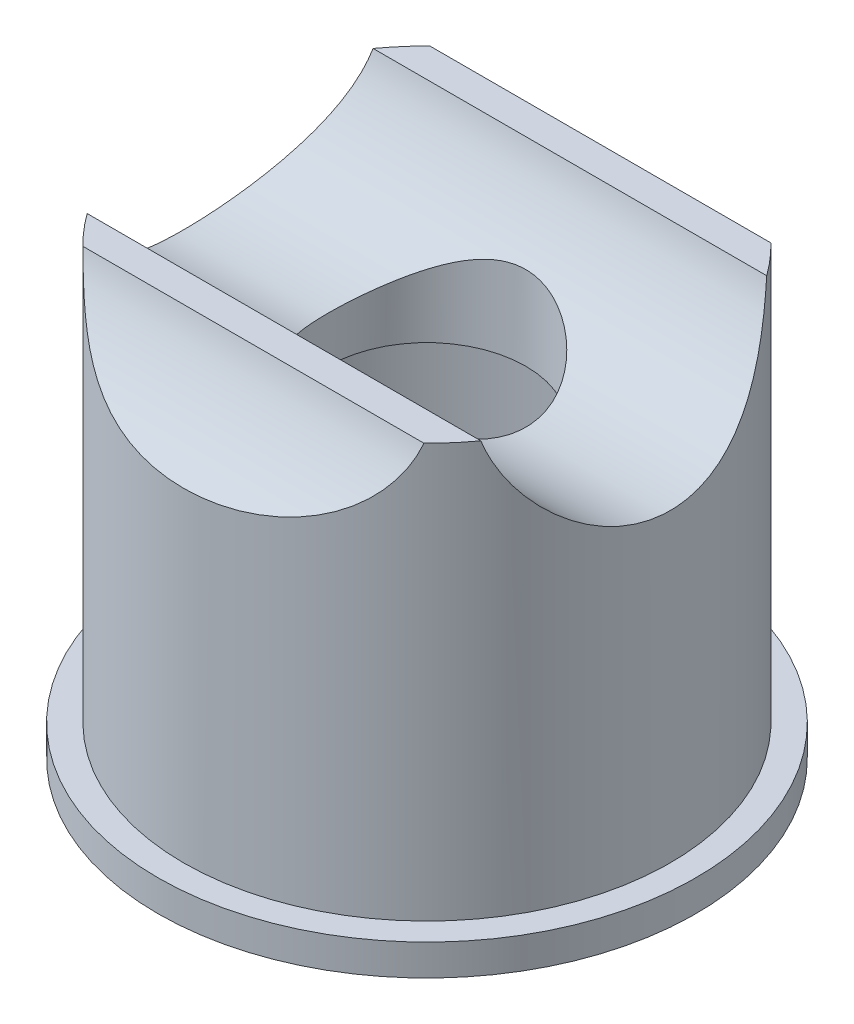
ISO-10303-21;
HEADER;
FILE_DESCRIPTION(('STEP AP214'),'2;1');
FILE_NAME('part.step','',(''),(''),'','','');
FILE_SCHEMA(('AUTOMOTIVE_DESIGN { 1 0 10303 214 1 1 1 1 }'));
ENDSEC;
DATA;
#1=APPLICATION_CONTEXT('core data for automotive mechanical design processes');
#2=APPLICATION_PROTOCOL_DEFINITION('international standard','automotive_design',2000,#1);
#3=PRODUCT_CONTEXT('',#1,'mechanical');
#4=PRODUCT('Part','Part','',(#3));
#5=PRODUCT_RELATED_PRODUCT_CATEGORY('part','',(#4));
#6=PRODUCT_DEFINITION_FORMATION('','',#4);
#7=PRODUCT_DEFINITION_CONTEXT('part definition',#1,'design');
#8=PRODUCT_DEFINITION('design','',#6,#7);
#9=PRODUCT_DEFINITION_SHAPE('','',#8);
#10=(LENGTH_UNIT() NAMED_UNIT(*) SI_UNIT(.MILLI.,.METRE.));
#11=(NAMED_UNIT(*) PLANE_ANGLE_UNIT() SI_UNIT($,.RADIAN.));
#12=(NAMED_UNIT(*) SI_UNIT($,.STERADIAN.) SOLID_ANGLE_UNIT());
#13=UNCERTAINTY_MEASURE_WITH_UNIT(LENGTH_MEASURE(1.E-05),#10,'distance_accuracy_value','');
#14=(GEOMETRIC_REPRESENTATION_CONTEXT(3) GLOBAL_UNCERTAINTY_ASSIGNED_CONTEXT((#13)) GLOBAL_UNIT_ASSIGNED_CONTEXT((#10,
#11,#12)) REPRESENTATION_CONTEXT('',''));
#15=CARTESIAN_POINT('',(0.,0.,0.));
#16=DIRECTION('',(0.,0.,1.));
#17=DIRECTION('',(1.,0.,0.));
#18=AXIS2_PLACEMENT_3D('',#15,#16,#17);
#19=CARTESIAN_POINT('',(0.,14.2875,0.));
#20=DIRECTION('',(0.,-1.,0.));
#21=DIRECTION('',(0.,0.,-1.));
#22=AXIS2_PLACEMENT_3D('',#19,#20,#21);
#23=CYLINDRICAL_SURFACE('',#22,8.636);
#24=CARTESIAN_POINT('',(0.,0.,0.));
#25=DIRECTION('',(0.,1.,0.));
#26=DIRECTION('',(0.,0.,1.));
#27=AXIS2_PLACEMENT_3D('',#24,#25,#26);
#28=CIRCLE('',#27,8.636);
#29=CARTESIAN_POINT('',(0.,0.,8.636));
#30=VERTEX_POINT('',#29);
#31=EDGE_CURVE('E92',#30,#30,#28,.T.);
#32=ORIENTED_EDGE('',*,*,#31,.T.);
#33=EDGE_LOOP('',(#32));
#34=FACE_BOUND('',#33,.T.);
#35=CARTESIAN_POINT('',(0.,0.999999999999999,0.));
#36=DIRECTION('',(0.,1.,0.));
#37=DIRECTION('',(0.,0.,1.));
#38=AXIS2_PLACEMENT_3D('',#35,#36,#37);
#39=CIRCLE('',#38,8.636);
#40=CARTESIAN_POINT('',(0.,0.999999999999999,8.636));
#41=VERTEX_POINT('',#40);
#42=EDGE_CURVE('E93',#41,#41,#39,.T.);
#43=ORIENTED_EDGE('',*,*,#42,.F.);
#44=EDGE_LOOP('',(#43));
#45=FACE_BOUND('',#44,.T.);
#46=ADVANCED_FACE('F35',(#34,#45),#23,.T.);
#47=CARTESIAN_POINT('',(0.,0.,0.));
#48=DIRECTION('',(0.,1.,0.));
#49=DIRECTION('',(0.,0.,1.));
#50=AXIS2_PLACEMENT_3D('',#47,#48,#49);
#51=PLANE('',#50);
#52=CARTESIAN_POINT('',(0.,0.,0.));
#53=DIRECTION('',(0.,1.,0.));
#54=DIRECTION('',(0.,0.,1.));
#55=AXIS2_PLACEMENT_3D('',#52,#53,#54);
#56=CIRCLE('',#55,7.7818);
#57=CARTESIAN_POINT('',(0.,0.,7.7818));
#58=VERTEX_POINT('',#57);
#59=EDGE_CURVE('E13',#58,#58,#56,.T.);
#60=ORIENTED_EDGE('',*,*,#59,.T.);
#61=EDGE_LOOP('',(#60));
#62=FACE_BOUND('',#61,.T.);
#63=ORIENTED_EDGE('',*,*,#31,.F.);
#64=EDGE_LOOP('',(#63));
#65=FACE_BOUND('',#64,.T.);
#66=ADVANCED_FACE('F175',(#62,#65),#51,.F.);
#67=CARTESIAN_POINT('',(0.,1.,0.));
#68=DIRECTION('',(0.,1.,0.));
#69=DIRECTION('',(0.,0.,1.));
#70=AXIS2_PLACEMENT_3D('',#67,#68,#69);
#71=PLANE('',#70);
#72=CARTESIAN_POINT('',(0.,1.,0.));
#73=DIRECTION('',(0.,1.,0.));
#74=DIRECTION('',(0.,0.,1.));
#75=AXIS2_PLACEMENT_3D('',#72,#73,#74);
#76=CIRCLE('',#75,7.8105);
#77=CARTESIAN_POINT('',(0.,1.,7.8105));
#78=VERTEX_POINT('',#77);
#79=EDGE_CURVE('E81',#78,#78,#76,.F.);
#80=ORIENTED_EDGE('',*,*,#79,.T.);
#81=EDGE_LOOP('',(#80));
#82=FACE_BOUND('',#81,.T.);
#83=ORIENTED_EDGE('',*,*,#42,.T.);
#84=EDGE_LOOP('',(#83));
#85=FACE_BOUND('',#84,.T.);
#86=ADVANCED_FACE('F127',(#82,#85),#71,.T.);
#87=CARTESIAN_POINT('',(0.,-24.6705596158012,0.));
#88=DIRECTION('',(0.,1.,0.));
#89=DIRECTION('',(0.,0.,1.));
#90=AXIS2_PLACEMENT_3D('',#87,#88,#89);
#91=CYLINDRICAL_SURFACE('',#90,7.8105);
#92=ORIENTED_EDGE('',*,*,#79,.F.);
#93=EDGE_LOOP('',(#92));
#94=FACE_BOUND('',#93,.T.);
#95=CARTESIAN_POINT('',(6.31944649474936,14.2875,-4.5900442535993));
#96=CARTESIAN_POINT('',(6.3459448331276,14.1555945571704,-4.55354104369366));
#97=CARTESIAN_POINT('',(6.37594767306263,14.0260762738664,-4.51159001928936));
#98=CARTESIAN_POINT('',(6.44157205161751,13.7724804518197,-4.41739810848748));
#99=CARTESIAN_POINT('',(6.4771869801665,13.6483967291085,-4.3651693097488));
#100=CARTESIAN_POINT('',(6.59018050800569,13.2857908252321,-4.19427296025745));
#101=CARTESIAN_POINT('',(6.67393683833757,13.0558723566797,-4.06110038894614));
#102=CARTESIAN_POINT('',(6.80418525062295,12.7318737221007,-3.83594792634909));
#103=CARTESIAN_POINT('',(6.84829480243364,12.6275071057137,-3.75681426350333));
#104=CARTESIAN_POINT('',(6.93701384745941,12.4257506882625,-3.59035569695324));
#105=CARTESIAN_POINT('',(6.9816233278826,12.3283607091532,-3.50303100241699));
#106=CARTESIAN_POINT('',(7.1147047259258,12.0469522384616,-3.22893469707014));
#107=CARTESIAN_POINT('',(7.20236176884486,11.8738569358692,-3.03015336093005));
#108=CARTESIAN_POINT('',(7.32897431117192,11.6336751584442,-2.70281244497699));
#109=CARTESIAN_POINT('',(7.37171042673759,11.554574838831,-2.58427290894523));
#110=CARTESIAN_POINT('',(7.45299439092094,11.4067844454627,-2.33952319840194));
#111=CARTESIAN_POINT('',(7.49154419608711,11.338089502586,-2.21331665059225));
#112=CARTESIAN_POINT('',(7.56329965909997,11.211964060112,-1.95409472077566));
#113=CARTESIAN_POINT('',(7.59651024901128,11.1545231538201,-1.82108577392781));
#114=CARTESIAN_POINT('',(7.65659863778372,11.0516433248164,-1.54912346194853));
#115=CARTESIAN_POINT('',(7.68347757236637,11.006202249494,-1.41017116817845));
#116=CARTESIAN_POINT('',(7.72744593399761,10.9323845095782,-1.14312565571556));
#117=CARTESIAN_POINT('',(7.74528760917973,10.9026794345231,-1.01552251027671));
#118=CARTESIAN_POINT('',(7.77475213335238,10.8538154706943,-0.757612395189718));
#119=CARTESIAN_POINT('',(7.7863758977093,10.8346550295861,-0.627305826460162));
#120=CARTESIAN_POINT('',(7.80306140620297,10.8071966319759,-0.365208943259196));
#121=CARTESIAN_POINT('',(7.80812684399766,10.7988925611265,-0.233419506168018));
#122=CARTESIAN_POINT('',(7.81155480826666,10.7932696833563,0.030475960199796));
#123=CARTESIAN_POINT('',(7.80991792028192,10.7959499168045,0.162581960812481));
#124=CARTESIAN_POINT('',(7.80059257515733,10.8112625708266,0.410001500374484));
#125=CARTESIAN_POINT('',(7.79365610015848,10.8226584792593,0.525422649626926));
#126=CARTESIAN_POINT('',(7.77479819315719,10.8537636043853,0.75476168011716));
#127=CARTESIAN_POINT('',(7.76287525328922,10.87347533573,0.868679095880669));
#128=CARTESIAN_POINT('',(7.73431421719726,10.9209632282834,1.0941656574162));
#129=CARTESIAN_POINT('',(7.71767815564419,10.9487359096785,1.2057357942377));
#130=CARTESIAN_POINT('',(7.68004999085637,11.0120292196131,1.42591937838375));
#131=CARTESIAN_POINT('',(7.65905620162005,11.0475528472609,1.53453166286441));
#132=CARTESIAN_POINT('',(7.58933915833914,11.1666223302576,1.85880254266141));
#133=CARTESIAN_POINT('',(7.53439477343751,11.2618339487242,2.06898233114453));
#134=CARTESIAN_POINT('',(7.41240048355558,11.4795961776805,2.4707261172935));
#135=CARTESIAN_POINT('',(7.34534197143789,11.6021662411398,2.66227672902237));
#136=CARTESIAN_POINT('',(7.1947292426526,11.8889319980013,3.0475896208374));
#137=CARTESIAN_POINT('',(7.11016236307069,12.0564490949588,3.23848970928986));
#138=CARTESIAN_POINT('',(6.93889640761993,12.4188192598922,3.59082860428513));
#139=CARTESIAN_POINT('',(6.85219786838382,12.6136655048652,3.7522747412343));
#140=CARTESIAN_POINT('',(6.67993826784907,13.0397603662859,4.05137897793576));
#141=CARTESIAN_POINT('',(6.59469952789987,13.2724181756638,4.18725011316603));
#142=CARTESIAN_POINT('',(6.47972552034991,13.6397195120202,4.36141926955737));
#143=CARTESIAN_POINT('',(6.44349826813045,13.7654322667229,4.41460030224131));
#144=CARTESIAN_POINT('',(6.3767887018944,14.0224455369685,4.51041414565521));
#145=CARTESIAN_POINT('',(6.3463130737242,14.1537523405932,4.55303469837239));
#146=CARTESIAN_POINT('',(6.31944649474936,14.2875,4.5900442535993));
#147=B_SPLINE_CURVE_WITH_KNOTS('',3,(#95,#96,#97,#98,#99,#100,#101,#102,#103,#104,#105,#106,
#107,#108,#109,#110,#111,#112,#113,#114,#115,#116,#117,#118,#119,#120,#121,#122,#123,#124,#125,
#126,#127,#128,#129,#130,#131,#132,#133,#134,#135,#136,#137,#138,#139,#140,#141,#142,#143,#144,
#145,#146),.UNSPECIFIED.,.F.,.F.,(4,2,2,2,2,2,2,2,2,2,2,2,2,2,2,2,2,2,2,2,2,2,2,2,2,4),(0.,
0.417760343736558,0.835032266047839,1.66630234534516,2.08059010946077,2.49486729710663,
3.32404032255111,3.76988842410777,4.215527245392,4.66075201565375,5.1058968641545,
5.50200249368627,5.89804979468257,6.29387394416335,6.68966351366335,7.0378218405443,
7.38608552381795,7.73419908895614,8.08244759085619,8.79090709630531,9.4998719591998,
10.2996890339228,11.0993067803423,11.9427156421478,12.3658432653113,12.7894597543947),.UNSPECIFIED.);
#148=CARTESIAN_POINT('',(6.31944649474936,14.2875,-4.5900442535993));
#149=VERTEX_POINT('',#148);
#150=CARTESIAN_POINT('',(6.31944649474936,14.2875,4.5900442535993));
#151=VERTEX_POINT('',#150);
#152=EDGE_CURVE('E76',#149,#151,#147,.T.);
#153=ORIENTED_EDGE('',*,*,#152,.T.);
#154=CARTESIAN_POINT('',(0.,14.2875,0.));
#155=DIRECTION('',(0.,1.,0.));
#156=DIRECTION('',(0.,0.,1.));
#157=AXIS2_PLACEMENT_3D('',#154,#155,#156);
#158=CIRCLE('',#157,7.8105);
#159=CARTESIAN_POINT('',(5.47535416508721,14.2875,5.5699557464007));
#160=VERTEX_POINT('',#159);
#161=EDGE_CURVE('E73',#160,#151,#158,.T.);
#162=ORIENTED_EDGE('',*,*,#161,.F.);
#163=CARTESIAN_POINT('',(5.47535416508721,14.2875,5.5699557464007));
#164=CARTESIAN_POINT('',(5.44700331511037,14.1867231884947,5.59781277957916));
#165=CARTESIAN_POINT('',(5.41508775394805,14.0878292428965,5.62877322927284));
#166=CARTESIAN_POINT('',(5.34423348807905,13.8945624139044,5.69609530731841));
#167=CARTESIAN_POINT('',(5.30529871652915,13.8001870358596,5.73245390885724));
#168=CARTESIAN_POINT('',(5.22076938469108,13.6172239377505,5.80953602899794));
#169=CARTESIAN_POINT('',(5.1752220068137,13.5286011657167,5.8502281203875));
#170=CARTESIAN_POINT('',(5.07746823874737,13.3569880522497,5.93527075529279));
#171=CARTESIAN_POINT('',(5.02526130174505,13.2739981741892,5.97962159912126));
#172=CARTESIAN_POINT('',(4.85915427050187,13.0343712530466,6.11661718399059));
#173=CARTESIAN_POINT('',(4.73556782068868,12.8866437064503,6.21339438996443));
#174=CARTESIAN_POINT('',(4.46540564750361,12.6165342307456,6.41030269646885));
#175=CARTESIAN_POINT('',(4.31879965722391,12.4941861701603,6.51043807416136));
#176=CARTESIAN_POINT('',(4.0617824742851,12.3130069490109,6.67234077271139));
#177=CARTESIAN_POINT('',(3.95693621127453,12.247024962303,6.73513902408238));
#178=CARTESIAN_POINT('',(3.74018998375592,12.1245919890717,6.85786981601166));
#179=CARTESIAN_POINT('',(3.62828831321704,12.0681433199818,6.9178016572499));
#180=CARTESIAN_POINT('',(3.39829122259294,11.9639805807971,7.0336434682709));
#181=CARTESIAN_POINT('',(3.28018705015663,11.9162793046934,7.08954747555255));
#182=CARTESIAN_POINT('',(3.038838721627,11.8288714839592,7.19630406713116));
#183=CARTESIAN_POINT('',(2.91559345610117,11.7891666758291,7.24715555301844));
#184=CARTESIAN_POINT('',(2.63250177539104,11.7076295793285,7.35542876736137));
#185=CARTESIAN_POINT('',(2.47140699724395,11.6678852098084,7.41116727629571));
#186=CARTESIAN_POINT('',(2.14395823507316,11.5982570904899,7.51243968663383));
#187=CARTESIAN_POINT('',(1.97760297390456,11.5683757557041,7.55797108790268));
#188=CARTESIAN_POINT('',(1.64095283945536,11.5172186235446,7.63813679795615));
#189=CARTESIAN_POINT('',(1.47065689554541,11.4959451945424,7.67276810711749));
#190=CARTESIAN_POINT('',(1.12739214602854,11.4610523057515,7.73066599626056));
#191=CARTESIAN_POINT('',(0.954423495637329,11.4474324031928,7.75393323366358));
#192=CARTESIAN_POINT('',(0.605069998804092,11.4270870458654,7.78902737533358));
#193=CARTESIAN_POINT('',(0.428668378987001,11.4204363031785,7.80073023062835));
#194=CARTESIAN_POINT('',(0.0753527993015615,11.4139525955918,7.81213637521598));
#195=CARTESIAN_POINT('',(-0.101561167537058,11.4141197238863,7.81183950048335));
#196=CARTESIAN_POINT('',(-0.454962293775418,11.4212831379051,7.79924382682879));
#197=CARTESIAN_POINT('',(-0.631449019654363,11.4282846818524,7.78693578682821));
#198=CARTESIAN_POINT('',(-0.982761820885241,11.4494763753113,7.75043736188553));
#199=CARTESIAN_POINT('',(-1.15758784932934,11.4636667272655,7.72624664231814));
#200=CARTESIAN_POINT('',(-1.51763588671332,11.5013061200482,7.66397742126415));
#201=CARTESIAN_POINT('',(-1.70263615882145,11.5253777501921,7.62498189088036));
#202=CARTESIAN_POINT('',(-2.06783564592269,11.5839347357998,7.5341468231194));
#203=CARTESIAN_POINT('',(-2.2480338984403,11.6184221620846,7.48230473201607));
#204=CARTESIAN_POINT('',(-2.60145563444365,11.6994159468394,7.36687344126714));
#205=CARTESIAN_POINT('',(-2.77469244451421,11.7458979392139,7.3033081303248));
#206=CARTESIAN_POINT('',(-3.11248989477583,11.8528962004662,7.16585650255264));
#207=CARTESIAN_POINT('',(-3.27705569236649,11.9134040086449,7.09197641847698));
#208=CARTESIAN_POINT('',(-3.54001844227188,12.0267490237722,6.96316048572241));
#209=CARTESIAN_POINT('',(-3.64156544871207,12.0749655801968,6.91054367275361));
#210=CARTESIAN_POINT('',(-3.83930251826676,12.1788383092132,6.80267095655516));
#211=CARTESIAN_POINT('',(-3.93549397316302,12.2344925360246,6.74741574598237));
#212=CARTESIAN_POINT('',(-4.12179077927068,12.3537126859969,6.63525227813975));
#213=CARTESIAN_POINT('',(-4.21189780056851,12.4172764243846,6.57834448066396));
#214=CARTESIAN_POINT('',(-4.38533877778011,12.5526778860196,6.46401589683021));
#215=CARTESIAN_POINT('',(-4.46867275094584,12.6245155881908,6.40659511177932));
#216=CARTESIAN_POINT('',(-4.62868778318713,12.7773918546136,6.29197462364408));
#217=CARTESIAN_POINT('',(-4.70529313445355,12.8585160310083,6.23478301304912));
#218=CARTESIAN_POINT('',(-4.85025319129479,13.0292655605653,6.12269146300042));
#219=CARTESIAN_POINT('',(-4.91860939027024,13.1188893697184,6.06779110992544));
#220=CARTESIAN_POINT('',(-5.04645713740746,13.3061060480051,5.96188428473108));
#221=CARTESIAN_POINT('',(-5.1059643995241,13.4036843025969,5.91087099048488));
#222=CARTESIAN_POINT('',(-5.21585389929367,13.6062382468805,5.81413254969051));
#223=CARTESIAN_POINT('',(-5.26624272791045,13.7112085166375,5.768403592242));
#224=CARTESIAN_POINT('',(-5.34372895317285,13.894585734095,5.69652117509602));
#225=CARTESIAN_POINT('',(-5.37324007047181,13.9713158407933,5.66865419077211));
#226=CARTESIAN_POINT('',(-5.42770618600222,14.1274641450065,5.61652197095321));
#227=CARTESIAN_POINT('',(-5.45266600150195,14.2068793936439,5.59225293240645));
#228=CARTESIAN_POINT('',(-5.47535416508721,14.2875,5.5699557464007));
#229=B_SPLINE_CURVE_WITH_KNOTS('',3,(#163,#164,#165,#166,#167,#168,#169,#170,#171,#172,#173,
#174,#175,#176,#177,#178,#179,#180,#181,#182,#183,#184,#185,#186,#187,#188,#189,#190,#191,#192,
#193,#194,#195,#196,#197,#198,#199,#200,#201,#202,#203,#204,#205,#206,#207,#208,#209,#210,#211,
#212,#213,#214,#215,#216,#217,#218,#219,#220,#221,#222,#223,#224,#225,#226,#227,#228),
.UNSPECIFIED.,.F.,.F.,(4,2,2,2,2,2,2,2,2,2,2,2,2,2,2,2,2,2,2,2,2,2,2,2,2,2,2,2,2,2,2,2,4),(0.,
0.324846621020494,0.649511779494691,0.971964902310887,1.29444451866945,1.9378842696916,
2.58217723403778,2.99833510981039,3.41459400333965,3.83145694656686,4.24841031771466,
4.77279898253336,5.29731595141742,5.82197713747297,6.34660796783304,6.87680723242998,
7.40701374437511,7.93762850530794,8.46825820961233,9.03928246916194,9.6104203319608,
10.1804069798886,10.7500506892423,11.1220834010711,11.4940189746934,11.8658520390189,
12.237684156201,12.6132723343391,12.9887924148436,13.3636374716725,13.7382104921413,
13.9984009758521,14.2583144450799),.UNSPECIFIED.);
#230=CARTESIAN_POINT('',(-5.47535416508721,14.2875,5.5699557464007));
#231=VERTEX_POINT('',#230);
#232=EDGE_CURVE('E57',#160,#231,#229,.T.);
#233=ORIENTED_EDGE('',*,*,#232,.T.);
#234=CARTESIAN_POINT('',(-6.31944649474936,14.2875,4.5900442535993));
#235=VERTEX_POINT('',#234);
#236=EDGE_CURVE('E84',#235,#231,#158,.T.);
#237=ORIENTED_EDGE('',*,*,#236,.F.);
#238=CARTESIAN_POINT('',(-6.31944649474936,14.2875,4.5900442535993));
#239=CARTESIAN_POINT('',(-6.3459448331276,14.1555945571705,4.55354104369366));
#240=CARTESIAN_POINT('',(-6.37594767306263,14.0260762738664,4.51159001928936));
#241=CARTESIAN_POINT('',(-6.44157205161751,13.7724804518197,4.41739810848748));
#242=CARTESIAN_POINT('',(-6.4771869801665,13.6483967291085,4.3651693097488));
#243=CARTESIAN_POINT('',(-6.59018050800569,13.2857908252321,4.19427296025745));
#244=CARTESIAN_POINT('',(-6.67393683833756,13.0558723566797,4.06110038894614));
#245=CARTESIAN_POINT('',(-6.80418525062295,12.7318737221007,3.83594792634909));
#246=CARTESIAN_POINT('',(-6.84829480243364,12.6275071057137,3.75681426350333));
#247=CARTESIAN_POINT('',(-6.93701384745941,12.4257506882625,3.59035569695324));
#248=CARTESIAN_POINT('',(-6.98162332788259,12.3283607091532,3.503031002417));
#249=CARTESIAN_POINT('',(-7.1147047259258,12.0469522384616,3.22893469707014));
#250=CARTESIAN_POINT('',(-7.20236176884485,11.8738569358692,3.03015336093005));
#251=CARTESIAN_POINT('',(-7.32897431117192,11.6336751584442,2.702812444977));
#252=CARTESIAN_POINT('',(-7.37171042673759,11.5545748388311,2.58427290894524));
#253=CARTESIAN_POINT('',(-7.45299439092093,11.4067844454627,2.33952319840195));
#254=CARTESIAN_POINT('',(-7.49154419608711,11.338089502586,2.21331665059226));
#255=CARTESIAN_POINT('',(-7.56329965909997,11.211964060112,1.95409472077566));
#256=CARTESIAN_POINT('',(-7.59651024901127,11.1545231538201,1.82108577392782));
#257=CARTESIAN_POINT('',(-7.65659863778371,11.0516433248164,1.54912346194854));
#258=CARTESIAN_POINT('',(-7.68347757236637,11.006202249494,1.41017116817846));
#259=CARTESIAN_POINT('',(-7.72744593399761,10.9323845095782,1.14312565571557));
#260=CARTESIAN_POINT('',(-7.74528760917973,10.9026794345231,1.01552251027672));
#261=CARTESIAN_POINT('',(-7.77475213335238,10.8538154706943,0.757612395189728));
#262=CARTESIAN_POINT('',(-7.7863758977093,10.8346550295861,0.627305826460172));
#263=CARTESIAN_POINT('',(-7.80306140620297,10.8071966319759,0.365208943259206));
#264=CARTESIAN_POINT('',(-7.80812684399766,10.7988925611265,0.233419506168028));
#265=CARTESIAN_POINT('',(-7.81155480826666,10.7932696833563,-0.0304759601997872));
#266=CARTESIAN_POINT('',(-7.80991792028192,10.7959499168045,-0.162581960812472));
#267=CARTESIAN_POINT('',(-7.80059257515733,10.8112625708266,-0.410001500374476));
#268=CARTESIAN_POINT('',(-7.79365610015848,10.8226584792593,-0.525422649626919));
#269=CARTESIAN_POINT('',(-7.77479819315719,10.8537636043853,-0.754761680117153));
#270=CARTESIAN_POINT('',(-7.76287525328922,10.87347533573,-0.868679095880662));
#271=CARTESIAN_POINT('',(-7.73431421719726,10.9209632282834,-1.09416565741619));
#272=CARTESIAN_POINT('',(-7.71767815564419,10.9487359096785,-1.20573579423769));
#273=CARTESIAN_POINT('',(-7.68004999085637,11.0120292196131,-1.42591937838375));
#274=CARTESIAN_POINT('',(-7.65905620162006,11.0475528472609,-1.5345316628644));
#275=CARTESIAN_POINT('',(-7.58933915833914,11.1666223302576,-1.85880254266141));
#276=CARTESIAN_POINT('',(-7.53439477343751,11.2618339487242,-2.06898233114452));
#277=CARTESIAN_POINT('',(-7.41240048355558,11.4795961776805,-2.4707261172935));
#278=CARTESIAN_POINT('',(-7.34534197143789,11.6021662411398,-2.66227672902236));
#279=CARTESIAN_POINT('',(-7.1947292426526,11.8889319980013,-3.04758962083739));
#280=CARTESIAN_POINT('',(-7.11016236307069,12.0564490949588,-3.23848970928985));
#281=CARTESIAN_POINT('',(-6.93889640761993,12.4188192598922,-3.59082860428512));
#282=CARTESIAN_POINT('',(-6.85219786838382,12.6136655048652,-3.75227474123429));
#283=CARTESIAN_POINT('',(-6.67993826784907,13.0397603662859,-4.05137897793575));
#284=CARTESIAN_POINT('',(-6.59469952789987,13.2724181756638,-4.18725011316603));
#285=CARTESIAN_POINT('',(-6.47972552034992,13.6397195120202,-4.36141926955737));
#286=CARTESIAN_POINT('',(-6.44349826813045,13.7654322667229,-4.41460030224131));
#287=CARTESIAN_POINT('',(-6.3767887018944,14.0224455369685,-4.5104141456552));
#288=CARTESIAN_POINT('',(-6.3463130737242,14.1537523405932,-4.55303469837239));
#289=CARTESIAN_POINT('',(-6.31944649474936,14.2875,-4.5900442535993));
#290=B_SPLINE_CURVE_WITH_KNOTS('',3,(#238,#239,#240,#241,#242,#243,#244,#245,#246,#247,#248,
#249,#250,#251,#252,#253,#254,#255,#256,#257,#258,#259,#260,#261,#262,#263,#264,#265,#266,#267,
#268,#269,#270,#271,#272,#273,#274,#275,#276,#277,#278,#279,#280,#281,#282,#283,#284,#285,#286,
#287,#288,#289),.UNSPECIFIED.,.F.,.F.,(4,2,2,2,2,2,2,2,2,2,2,2,2,2,2,2,2,2,2,2,2,2,2,2,2,4),(0.,
0.417760343736558,0.835032266047839,1.66630234534516,2.08059010946077,2.49486729710662,
3.3240403225511,3.76988842410777,4.21552724539199,4.66075201565374,5.10589686415449,
5.50200249368626,5.89804979468256,6.29387394416334,6.68966351366334,7.0378218405443,
7.38608552381794,7.73419908895614,8.08244759085619,8.7909070963053,9.4998719591998,
10.2996890339228,11.0993067803423,11.9427156421478,12.3658432653113,12.7894597543947),.UNSPECIFIED.);
#291=CARTESIAN_POINT('',(-6.31944649474936,14.2875,-4.5900442535993));
#292=VERTEX_POINT('',#291);
#293=EDGE_CURVE('E89',#235,#292,#290,.T.);
#294=ORIENTED_EDGE('',*,*,#293,.T.);
#295=CARTESIAN_POINT('',(-5.47535416508722,14.2875,-5.56995574640069));
#296=VERTEX_POINT('',#295);
#297=EDGE_CURVE('E50',#296,#292,#158,.T.);
#298=ORIENTED_EDGE('',*,*,#297,.F.);
#299=CARTESIAN_POINT('',(-5.47535416508722,14.2875,-5.56995574640069));
#300=CARTESIAN_POINT('',(-5.44700331511038,14.1867231884947,-5.59781277957916));
#301=CARTESIAN_POINT('',(-5.41508775394806,14.0878292428965,-5.62877322927284));
#302=CARTESIAN_POINT('',(-5.34423348807906,13.8945624139044,-5.69609530731841));
#303=CARTESIAN_POINT('',(-5.30529871652916,13.8001870358596,-5.73245390885724));
#304=CARTESIAN_POINT('',(-5.22076938469108,13.6172239377505,-5.80953602899793));
#305=CARTESIAN_POINT('',(-5.1752220068137,13.5286011657167,-5.85022812038749));
#306=CARTESIAN_POINT('',(-5.07746823874738,13.3569880522497,-5.93527075529279));
#307=CARTESIAN_POINT('',(-5.02526130174506,13.2739981741892,-5.97962159912125));
#308=CARTESIAN_POINT('',(-4.85915427050188,13.0343712530466,-6.11661718399058));
#309=CARTESIAN_POINT('',(-4.73556782068869,12.8866437064503,-6.21339438996442));
#310=CARTESIAN_POINT('',(-4.46540564750362,12.6165342307456,-6.41030269646884));
#311=CARTESIAN_POINT('',(-4.31879965722392,12.4941861701603,-6.51043807416135));
#312=CARTESIAN_POINT('',(-4.06178247428511,12.3130069490109,-6.67234077271139));
#313=CARTESIAN_POINT('',(-3.95693621127454,12.247024962303,-6.73513902408237));
#314=CARTESIAN_POINT('',(-3.74018998375593,12.1245919890717,-6.85786981601165));
#315=CARTESIAN_POINT('',(-3.62828831321705,12.0681433199818,-6.91780165724989));
#316=CARTESIAN_POINT('',(-3.39829122259295,11.9639805807971,-7.03364346827089));
#317=CARTESIAN_POINT('',(-3.28018705015664,11.9162793046934,-7.08954747555255));
#318=CARTESIAN_POINT('',(-3.03883872162701,11.8288714839592,-7.19630406713116));
#319=CARTESIAN_POINT('',(-2.91559345610118,11.7891666758291,-7.24715555301843));
#320=CARTESIAN_POINT('',(-2.63250177539105,11.7076295793285,-7.35542876736137));
#321=CARTESIAN_POINT('',(-2.47140699724396,11.6678852098084,-7.41116727629571));
#322=CARTESIAN_POINT('',(-2.14395823507316,11.5982570904899,-7.51243968663382));
#323=CARTESIAN_POINT('',(-1.97760297390457,11.5683757557041,-7.55797108790268));
#324=CARTESIAN_POINT('',(-1.64095283945537,11.5172186235446,-7.63813679795615));
#325=CARTESIAN_POINT('',(-1.47065689554542,11.4959451945424,-7.67276810711749));
#326=CARTESIAN_POINT('',(-1.12739214602854,11.4610523057515,-7.73066599626056));
#327=CARTESIAN_POINT('',(-0.954423495637338,11.4474324031928,-7.75393323366358));
#328=CARTESIAN_POINT('',(-0.605069998804101,11.4270870458654,-7.78902737533357));
#329=CARTESIAN_POINT('',(-0.428668378987012,11.4204363031784,-7.80073023062835));
#330=CARTESIAN_POINT('',(-0.0753527993015722,11.4139525955918,-7.81213637521598));
#331=CARTESIAN_POINT('',(0.101561167537047,11.4141197238863,-7.81183950048335));
#332=CARTESIAN_POINT('',(0.454962293775407,11.421283137905,-7.79924382682879));
#333=CARTESIAN_POINT('',(0.631449019654353,11.4282846818524,-7.78693578682821));
#334=CARTESIAN_POINT('',(0.982761820885231,11.4494763753113,-7.75043736188553));
#335=CARTESIAN_POINT('',(1.15758784932933,11.4636667272655,-7.72624664231814));
#336=CARTESIAN_POINT('',(1.51763588671331,11.5013061200482,-7.66397742126416));
#337=CARTESIAN_POINT('',(1.70263615882143,11.5253777501921,-7.62498189088036));
#338=CARTESIAN_POINT('',(2.06783564592268,11.5839347357998,-7.5341468231194));
#339=CARTESIAN_POINT('',(2.24803389844029,11.6184221620846,-7.48230473201607));
#340=CARTESIAN_POINT('',(2.60145563444364,11.6994159468394,-7.36687344126714));
#341=CARTESIAN_POINT('',(2.7746924445142,11.7458979392139,-7.3033081303248));
#342=CARTESIAN_POINT('',(3.11248989477582,11.8528962004662,-7.16585650255265));
#343=CARTESIAN_POINT('',(3.27705569236648,11.9134040086449,-7.09197641847698));
#344=CARTESIAN_POINT('',(3.54001844227187,12.0267490237722,-6.96316048572241));
#345=CARTESIAN_POINT('',(3.64156544871206,12.0749655801968,-6.91054367275362));
#346=CARTESIAN_POINT('',(3.83930251826675,12.1788383092131,-6.80267095655517));
#347=CARTESIAN_POINT('',(3.93549397316301,12.2344925360246,-6.74741574598238));
#348=CARTESIAN_POINT('',(4.12179077927068,12.3537126859969,-6.63525227813975));
#349=CARTESIAN_POINT('',(4.2118978005685,12.4172764243846,-6.57834448066396));
#350=CARTESIAN_POINT('',(4.38533877778011,12.5526778860196,-6.46401589683021));
#351=CARTESIAN_POINT('',(4.46867275094584,12.6245155881908,-6.40659511177932));
#352=CARTESIAN_POINT('',(4.62868778318712,12.7773918546136,-6.29197462364409));
#353=CARTESIAN_POINT('',(4.70529313445354,12.8585160310083,-6.23478301304912));
#354=CARTESIAN_POINT('',(4.85025319129479,13.0292655605653,-6.12269146300043));
#355=CARTESIAN_POINT('',(4.91860939027024,13.1188893697184,-6.06779110992544));
#356=CARTESIAN_POINT('',(5.04645713740746,13.3061060480051,-5.96188428473108));
#357=CARTESIAN_POINT('',(5.1059643995241,13.4036843025969,-5.91087099048488));
#358=CARTESIAN_POINT('',(5.21585389929367,13.6062382468804,-5.81413254969051));
#359=CARTESIAN_POINT('',(5.26624272791045,13.7112085166375,-5.768403592242));
#360=CARTESIAN_POINT('',(5.34372895317285,13.894585734095,-5.69652117509602));
#361=CARTESIAN_POINT('',(5.37324007047181,13.9713158407933,-5.66865419077211));
#362=CARTESIAN_POINT('',(5.42770618600222,14.1274641450065,-5.61652197095321));
#363=CARTESIAN_POINT('',(5.45266600150196,14.2068793936439,-5.59225293240644));
#364=CARTESIAN_POINT('',(5.47535416508722,14.2875,-5.56995574640069));
#365=B_SPLINE_CURVE_WITH_KNOTS('',3,(#299,#300,#301,#302,#303,#304,#305,#306,#307,#308,#309,
#310,#311,#312,#313,#314,#315,#316,#317,#318,#319,#320,#321,#322,#323,#324,#325,#326,#327,#328,
#329,#330,#331,#332,#333,#334,#335,#336,#337,#338,#339,#340,#341,#342,#343,#344,#345,#346,#347,
#348,#349,#350,#351,#352,#353,#354,#355,#356,#357,#358,#359,#360,#361,#362,#363,#364),
.UNSPECIFIED.,.F.,.F.,(4,2,2,2,2,2,2,2,2,2,2,2,2,2,2,2,2,2,2,2,2,2,2,2,2,2,2,2,2,2,2,2,4),(0.,
0.324846621020495,0.649511779494692,0.971964902310888,1.29444451866945,1.9378842696916,
2.58217723403778,2.99833510981039,3.41459400333966,3.83145694656687,4.24841031771466,
4.77279898253337,5.29731595141742,5.82197713747298,6.34660796783305,6.87680723242998,
7.40701374437511,7.93762850530794,8.46825820961234,9.03928246916194,9.6104203319608,
10.1804069798886,10.7500506892423,11.1220834010711,11.4940189746934,11.8658520390189,
12.237684156201,12.6132723343391,12.9887924148436,13.3636374716725,13.7382104921414,
13.9984009758521,14.2583144450799),.UNSPECIFIED.);
#366=CARTESIAN_POINT('',(5.47535416508722,14.2875,-5.56995574640069));
#367=VERTEX_POINT('',#366);
#368=EDGE_CURVE('E115',#296,#367,#365,.T.);
#369=ORIENTED_EDGE('',*,*,#368,.T.);
#370=EDGE_CURVE('E82',#149,#367,#158,.T.);
#371=ORIENTED_EDGE('',*,*,#370,.F.);
#372=EDGE_LOOP('',(#153,#162,#233,#237,#294,#298,#369,#371));
#373=FACE_BOUND('',#372,.T.);
#374=ADVANCED_FACE('F74',(#94,#373),#91,.T.);
#375=CARTESIAN_POINT('',(-8.636,15.5575,-10.16));
#376=DIRECTION('',(1.,0.,0.));
#377=DIRECTION('',(0.,0.,-1.));
#378=AXIS2_PLACEMENT_3D('',#375,#376,#377);
#379=CYLINDRICAL_SURFACE('',#378,4.76250000000001);
#380=ORIENTED_EDGE('',*,*,#368,.F.);
#381=DIRECTION('',(1.,0.,0.));
#382=VECTOR('',#381,1.);
#383=CARTESIAN_POINT('',(-8.636,14.2875,-5.56995574640069));
#384=LINE('',#383,#382);
#385=EDGE_CURVE('E112',#296,#367,#384,.T.);
#386=ORIENTED_EDGE('',*,*,#385,.T.);
#387=EDGE_LOOP('',(#380,#386));
#388=FACE_BOUND('',#387,.T.);
#389=ADVANCED_FACE('F121',(#388),#379,.F.);
#390=CARTESIAN_POINT('',(-8.636,15.5575,0.));
#391=DIRECTION('',(1.,0.,0.));
#392=DIRECTION('',(0.,0.,-1.));
#393=AXIS2_PLACEMENT_3D('',#390,#391,#392);
#394=CYLINDRICAL_SURFACE('',#393,4.7625);
#395=CARTESIAN_POINT('',(0.,12.0077420857191,3.175));
#396=CARTESIAN_POINT('',(-0.0775303130892568,12.0077503599343,3.17500484576827));
#397=CARTESIAN_POINT('',(-0.155026294344857,12.0051920526445,3.1721556587343));
#398=CARTESIAN_POINT('',(-0.309290006512053,11.9951249160571,3.16084602870887));
#399=CARTESIAN_POINT('',(-0.386057619312079,11.9876152973207,3.15238469091285));
#400=CARTESIAN_POINT('',(-0.614422890117654,11.9581111798568,3.11877225231689));
#401=CARTESIAN_POINT('',(-0.763997623736164,11.9291420075946,3.0853929885701));
#402=CARTESIAN_POINT('',(-1.05212661781048,11.857731778059,2.99935785351024));
#403=CARTESIAN_POINT('',(-1.19077248347449,11.815422021546,2.94688912119207));
#404=CARTESIAN_POINT('',(-1.45710374222937,11.7223506815136,2.82470091022495));
#405=CARTESIAN_POINT('',(-1.58478685167322,11.6715873434749,2.7549778490209));
#406=CARTESIAN_POINT('',(-1.84728822286527,11.5578586141404,2.58766885557099));
#407=CARTESIAN_POINT('',(-1.98012347446768,11.4942238378642,2.48743519963699));
#408=CARTESIAN_POINT('',(-2.22887057951207,11.367367413036,2.26723292903927));
#409=CARTESIAN_POINT('',(-2.34476574887366,11.3041462295746,2.14724510270102));
#410=CARTESIAN_POINT('',(-2.51195425151352,11.2091431776913,1.94419368751008));
#411=CARTESIAN_POINT('',(-2.56969979024176,11.175464910746,1.86724400494194));
#412=CARTESIAN_POINT('',(-2.678414283062,11.1108417357373,1.70764042398512));
#413=CARTESIAN_POINT('',(-2.72938635617953,11.0798955718219,1.62498917785726));
#414=CARTESIAN_POINT('',(-2.82396661882382,11.0216226226197,1.45442160053206));
#415=CARTESIAN_POINT('',(-2.86757884139952,10.9942938568543,1.36650818891102));
#416=CARTESIAN_POINT('',(-2.94683992359477,10.9440732870756,1.18594835879345));
#417=CARTESIAN_POINT('',(-2.98249048897753,10.9211805327985,1.09330295934871));
#418=CARTESIAN_POINT('',(-3.04168737104099,10.8828669684311,0.914657611479678));
#419=CARTESIAN_POINT('',(-3.06614243894167,10.8668963102012,0.829076462973848));
#420=CARTESIAN_POINT('',(-3.1078834845324,10.8395054358598,0.655478654592643));
#421=CARTESIAN_POINT('',(-3.12517086623115,10.828084328598,0.567462475298446));
#422=CARTESIAN_POINT('',(-3.15225014551956,10.8101472571832,0.389870000382387));
#423=CARTESIAN_POINT('',(-3.16204941028754,10.8036264719571,0.300295327079504));
#424=CARTESIAN_POINT('',(-3.17399644038159,10.7956706102042,0.120445655332521));
#425=CARTESIAN_POINT('',(-3.17614528529924,10.7942348161073,0.0301707575028497));
#426=CARTESIAN_POINT('',(-3.17153058764431,10.7973157032179,-0.212847482025028));
#427=CARTESIAN_POINT('',(-3.15754934882403,10.8066532880708,-0.365477283401845));
#428=CARTESIAN_POINT('',(-3.10818598858135,10.8393148543069,-0.665571061923042));
#429=CARTESIAN_POINT('',(-3.07280230640607,10.8626398557082,-0.813034661497298));
#430=CARTESIAN_POINT('',(-2.9826003760419,10.9211744416131,-1.09866580308969));
#431=CARTESIAN_POINT('',(-2.92785937303013,10.95633676304,-1.2368677334448));
#432=CARTESIAN_POINT('',(-2.80105898860202,11.0359645903553,-1.50210915896257));
#433=CARTESIAN_POINT('',(-2.72899644590943,11.0804317942439,-1.62914661076028));
#434=CARTESIAN_POINT('',(-2.55908362709179,11.1820634426485,-1.88640062998471));
#435=CARTESIAN_POINT('',(-2.45908902241075,11.2401285429052,-2.01484129193776));
#436=CARTESIAN_POINT('',(-2.24171088064502,11.3601404134673,-2.2542312534673));
#437=CARTESIAN_POINT('',(-2.12430052063017,11.4220930847693,-2.36515301728574));
#438=CARTESIAN_POINT('',(-1.8542583924647,11.5546180472427,-2.58400917496166));
#439=CARTESIAN_POINT('',(-1.69898840795544,11.6250351727005,-2.688805774772));
#440=CARTESIAN_POINT('',(-1.36920313322987,11.7558246752189,-2.87075365584123));
#441=CARTESIAN_POINT('',(-1.19472075954532,11.8162138012382,-2.94795128728295));
#442=CARTESIAN_POINT('',(-0.881508488474716,11.9020769343395,-3.0532819999139));
#443=CARTESIAN_POINT('',(-0.746770524903296,11.9325967124619,-3.08912881829449));
#444=CARTESIAN_POINT('',(-0.471424810046956,11.9791314932078,-3.1429254455291));
#445=CARTESIAN_POINT('',(-0.330827679805211,11.9951716410117,-3.16090628575237));
#446=CARTESIAN_POINT('',(-0.0469217589822023,12.0102700328942,-3.17784797716998));
#447=CARTESIAN_POINT('',(0.0963961409364326,12.0092544000119,-3.17672608475743));
#448=CARTESIAN_POINT('',(0.380498086367867,11.9902306490007,-3.15534087182034));
#449=CARTESIAN_POINT('',(0.521279983669346,11.9722087568244,-3.13506203530837));
#450=CARTESIAN_POINT('',(0.789605700475683,11.9232683576478,-3.07815950249654));
#451=CARTESIAN_POINT('',(0.917460238421972,11.8930231569865,-3.04238302035307));
#452=CARTESIAN_POINT('',(1.16542540010427,11.8232244100146,-2.95629078554842));
#453=CARTESIAN_POINT('',(1.28553340655723,11.7836677384545,-2.90597015007478));
#454=CARTESIAN_POINT('',(1.54019568096771,11.6901676973083,-2.78071812737818));
#455=CARTESIAN_POINT('',(1.67283893828621,11.6349290820678,-2.70287795751937));
#456=CARTESIAN_POINT('',(1.92471167419282,11.5210825776074,-2.52972461255558));
#457=CARTESIAN_POINT('',(2.04392453283964,11.4624706465052,-2.43439016364708));
#458=CARTESIAN_POINT('',(2.29229022659132,11.3335486065961,-2.20466694119548));
#459=CARTESIAN_POINT('',(2.417925771591,11.2634799472849,-2.06629613591577));
#460=CARTESIAN_POINT('',(2.64448398417092,11.1319376382793,-1.76704543824849));
#461=CARTESIAN_POINT('',(2.74542848686949,11.0704564152206,-1.60618563296259));
#462=CARTESIAN_POINT('',(2.90177813553213,10.9729457127771,-1.29776136627992));
#463=CARTESIAN_POINT('',(2.96220595080281,10.9342958524883,-1.15357650425641));
#464=CARTESIAN_POINT('',(3.06166392097997,10.8699505126102,-0.855276862945686));
#465=CARTESIAN_POINT('',(3.10071214827543,10.8442440932774,-0.701170593878595));
#466=CARTESIAN_POINT('',(3.15546893010853,10.8080434710801,-0.386348910278902));
#467=CARTESIAN_POINT('',(3.17107360377126,10.7976169801709,-0.225607303606703));
#468=CARTESIAN_POINT('',(3.17761596407024,10.7932565911454,0.0966081801862638));
#469=CARTESIAN_POINT('',(3.1685559435273,10.7993211600262,0.258081987848815));
#470=CARTESIAN_POINT('',(3.1279155613934,10.8262807989237,0.564765082925261));
#471=CARTESIAN_POINT('',(3.09802056221114,10.8460654745234,0.710303289757512));
#472=CARTESIAN_POINT('',(3.01904715934909,10.897614313735,0.993804246374775));
#473=CARTESIAN_POINT('',(2.96996577560697,10.9293803382838,1.13176581554505));
#474=CARTESIAN_POINT('',(2.8512473086722,11.0046807238121,1.40517133388981));
#475=CARTESIAN_POINT('',(2.78058514710331,11.0487896764462,1.54000769986339));
#476=CARTESIAN_POINT('',(2.62231084139834,11.1446403907905,1.79633985000038));
#477=CARTESIAN_POINT('',(2.53468855501107,11.1963867152733,1.917827583115));
#478=CARTESIAN_POINT('',(2.32945166194027,11.3126372279008,2.16422958614352));
#479=CARTESIAN_POINT('',(2.20928737774187,11.3778679273742,2.28667757230637));
#480=CARTESIAN_POINT('',(1.95085707483912,11.5085278870921,2.51079031886472));
#481=CARTESIAN_POINT('',(1.81257764009868,11.5739572590424,2.61243953137712));
#482=CARTESIAN_POINT('',(1.53056081633913,11.6937758179387,2.78627302038784));
#483=CARTESIAN_POINT('',(1.38804584738439,11.7486264994717,2.86011420444801));
#484=CARTESIAN_POINT('',(1.09015872088625,11.8467576622129,2.98633792804776));
#485=CARTESIAN_POINT('',(0.934812256068547,11.8900605638718,3.03876215630907));
#486=CARTESIAN_POINT('',(0.649656709289902,11.9508442216558,3.11048942328417));
#487=CARTESIAN_POINT('',(0.521819648988657,11.9719211026724,3.13455833161691));
#488=CARTESIAN_POINT('',(0.262620257047792,12.0003573711413,3.16680296090891));
#489=CARTESIAN_POINT('',(0.13126092515377,12.0077280772481,3.17499179598275));
#490=CARTESIAN_POINT('',(0.,12.0077420857191,3.175));
#491=B_SPLINE_CURVE_WITH_KNOTS('',3,(#395,#396,#397,#398,#399,#400,#401,#402,#403,#404,#405,
#406,#407,#408,#409,#410,#411,#412,#413,#414,#415,#416,#417,#418,#419,#420,#421,#422,#423,#424,
#425,#426,#427,#428,#429,#430,#431,#432,#433,#434,#435,#436,#437,#438,#439,#440,#441,#442,#443,
#444,#445,#446,#447,#448,#449,#450,#451,#452,#453,#454,#455,#456,#457,#458,#459,#460,#461,#462,
#463,#464,#465,#466,#467,#468,#469,#470,#471,#472,#473,#474,#475,#476,#477,#478,#479,#480,#481,
#482,#483,#484,#485,#486,#487,#488,#489,#490),.UNSPECIFIED.,.T.,.F.,(4,2,2,2,2,2,2,2,2,2,2,2,2,
2,2,2,2,2,2,2,2,2,2,2,2,2,2,2,2,2,2,2,2,2,2,2,2,2,2,2,2,2,2,2,2,2,2,4),(0.,0.23243124625734,
0.464899560397763,0.930088037462965,1.39083389168218,1.85167549198281,2.38425030634412,
2.917346163045,3.22278328993201,3.52807927902229,3.83320742500146,4.1382701352628,
4.40914536226321,4.6799675050406,4.95052285537199,5.2210400246797,5.67924012217537,
6.13747363750744,6.59389883732737,7.05040740058809,7.5669044791558,8.0842054646496,
8.68182442289395,9.27843496193814,9.70492668987399,10.1306763437413,10.5582706022568,
10.9862114839362,11.3932386756601,11.8004026749734,12.2889502819408,12.7780959690837,
13.37409312163,13.9695612926994,14.4506704720704,14.9313723344642,15.4141980194601,
15.8969788226923,16.3446564230742,16.7924035851585,17.2660585797609,17.7399977027657,
18.2884775296264,18.837365880255,19.3443542518826,19.8503509991662,20.2441887886898,
20.6377011995485),.UNSPECIFIED.);
#492=CARTESIAN_POINT('',(0.,12.0077420857191,3.175));
#493=VERTEX_POINT('',#492);
#494=EDGE_CURVE('E150',#493,#493,#491,.T.);
#495=ORIENTED_EDGE('',*,*,#494,.T.);
#496=EDGE_LOOP('',(#495));
#497=FACE_BOUND('',#496,.T.);
#498=ORIENTED_EDGE('',*,*,#152,.F.);
#499=DIRECTION('',(1.,0.,0.));
#500=VECTOR('',#499,1.);
#501=CARTESIAN_POINT('',(-8.636,14.2875,-4.5900442535993));
#502=LINE('',#501,#500);
#503=EDGE_CURVE('E96',#149,#292,#502,.F.);
#504=ORIENTED_EDGE('',*,*,#503,.T.);
#505=ORIENTED_EDGE('',*,*,#293,.F.);
#506=DIRECTION('',(1.,0.,0.));
#507=VECTOR('',#506,1.);
#508=CARTESIAN_POINT('',(-8.636,14.2875,4.5900442535993));
#509=LINE('',#508,#507);
#510=EDGE_CURVE('E110',#235,#151,#509,.T.);
#511=ORIENTED_EDGE('',*,*,#510,.T.);
#512=EDGE_LOOP('',(#498,#504,#505,#511));
#513=FACE_BOUND('',#512,.T.);
#514=ADVANCED_FACE('F140',(#497,#513),#394,.F.);
#515=CARTESIAN_POINT('',(0.,14.2875,0.));
#516=DIRECTION('',(0.,1.,0.));
#517=DIRECTION('',(0.,0.,1.));
#518=AXIS2_PLACEMENT_3D('',#515,#516,#517);
#519=PLANE('',#518);
#520=ORIENTED_EDGE('',*,*,#503,.F.);
#521=ORIENTED_EDGE('',*,*,#370,.T.);
#522=ORIENTED_EDGE('',*,*,#385,.F.);
#523=ORIENTED_EDGE('',*,*,#297,.T.);
#524=EDGE_LOOP('',(#520,#521,#522,#523));
#525=FACE_BOUND('',#524,.T.);
#526=ADVANCED_FACE('F144',(#525),#519,.T.);
#527=CARTESIAN_POINT('',(-8.636,15.5575,10.16));
#528=DIRECTION('',(1.,0.,0.));
#529=DIRECTION('',(0.,0.,-1.));
#530=AXIS2_PLACEMENT_3D('',#527,#528,#529);
#531=CYLINDRICAL_SURFACE('',#530,4.7625);
#532=ORIENTED_EDGE('',*,*,#232,.F.);
#533=DIRECTION('',(1.,0.,0.));
#534=VECTOR('',#533,1.);
#535=CARTESIAN_POINT('',(-8.636,14.2875,5.5699557464007));
#536=LINE('',#535,#534);
#537=EDGE_CURVE('E88',#160,#231,#536,.F.);
#538=ORIENTED_EDGE('',*,*,#537,.T.);
#539=EDGE_LOOP('',(#532,#538));
#540=FACE_BOUND('',#539,.T.);
#541=ADVANCED_FACE('F87',(#540),#531,.F.);
#542=ORIENTED_EDGE('',*,*,#537,.F.);
#543=ORIENTED_EDGE('',*,*,#161,.T.);
#544=ORIENTED_EDGE('',*,*,#510,.F.);
#545=ORIENTED_EDGE('',*,*,#236,.T.);
#546=EDGE_LOOP('',(#542,#543,#544,#545));
#547=FACE_BOUND('',#546,.T.);
#548=ADVANCED_FACE('F91',(#547),#519,.T.);
#549=CARTESIAN_POINT('',(0.,0.,0.));
#550=DIRECTION('',(0.,1.,0.));
#551=DIRECTION('',(0.,0.,1.));
#552=AXIS2_PLACEMENT_3D('',#549,#550,#551);
#553=CYLINDRICAL_SURFACE('',#552,3.175);
#554=CARTESIAN_POINT('',(0.,9.31875,0.));
#555=DIRECTION('',(0.,1.,0.));
#556=DIRECTION('',(0.,0.,1.));
#557=AXIS2_PLACEMENT_3D('',#554,#555,#556);
#558=CIRCLE('',#557,3.175);
#559=CARTESIAN_POINT('',(0.,9.31875,3.175));
#560=VERTEX_POINT('',#559);
#561=EDGE_CURVE('E155',#560,#560,#558,.F.);
#562=ORIENTED_EDGE('',*,*,#561,.T.);
#563=EDGE_LOOP('',(#562));
#564=FACE_BOUND('',#563,.T.);
#565=ORIENTED_EDGE('',*,*,#494,.F.);
#566=EDGE_LOOP('',(#565));
#567=FACE_BOUND('',#566,.T.);
#568=ADVANCED_FACE('F156',(#564,#567),#553,.F.);
#569=CARTESIAN_POINT('',(0.,9.31875,0.));
#570=DIRECTION('',(0.,1.,0.));
#571=DIRECTION('',(0.,0.,1.));
#572=AXIS2_PLACEMENT_3D('',#569,#570,#571);
#573=PLANE('',#572);
#574=CARTESIAN_POINT('',(0.,9.31875,0.));
#575=DIRECTION('',(0.,1.,0.));
#576=DIRECTION('',(0.,0.,1.));
#577=AXIS2_PLACEMENT_3D('',#574,#575,#576);
#578=CIRCLE('',#577,6.7818);
#579=CARTESIAN_POINT('',(0.,9.31875,6.7818));
#580=VERTEX_POINT('',#579);
#581=EDGE_CURVE('E192',#580,#580,#578,.F.);
#582=ORIENTED_EDGE('',*,*,#581,.T.);
#583=EDGE_LOOP('',(#582));
#584=FACE_BOUND('',#583,.T.);
#585=ORIENTED_EDGE('',*,*,#561,.F.);
#586=EDGE_LOOP('',(#585));
#587=FACE_BOUND('',#586,.T.);
#588=ADVANCED_FACE('F160',(#584,#587),#573,.F.);
#589=CARTESIAN_POINT('',(0.,33.4693270746037,0.));
#590=DIRECTION('',(0.,-1.,0.));
#591=DIRECTION('',(0.,0.,-1.));
#592=AXIS2_PLACEMENT_3D('',#589,#590,#591);
#593=CYLINDRICAL_SURFACE('',#592,6.7818);
#594=CARTESIAN_POINT('',(0.,1.,0.));
#595=DIRECTION('',(0.,1.,0.));
#596=DIRECTION('',(0.,0.,1.));
#597=AXIS2_PLACEMENT_3D('',#594,#595,#596);
#598=CIRCLE('',#597,6.7818);
#599=CARTESIAN_POINT('',(0.,1.,6.7818));
#600=VERTEX_POINT('',#599);
#601=EDGE_CURVE('E43',#600,#600,#598,.F.);
#602=ORIENTED_EDGE('',*,*,#601,.T.);
#603=EDGE_LOOP('',(#602));
#604=FACE_BOUND('',#603,.T.);
#605=ORIENTED_EDGE('',*,*,#581,.F.);
#606=EDGE_LOOP('',(#605));
#607=FACE_BOUND('',#606,.T.);
#608=ADVANCED_FACE('F164',(#604,#607),#593,.F.);
#609=CARTESIAN_POINT('',(0.,1.,0.));
#610=DIRECTION('',(0.,1.,0.));
#611=DIRECTION('',(0.,0.,1.));
#612=AXIS2_PLACEMENT_3D('',#609,#610,#611);
#613=TOROIDAL_SURFACE('',#612,7.7818,1.);
#614=ORIENTED_EDGE('',*,*,#59,.F.);
#615=EDGE_LOOP('',(#614));
#616=FACE_BOUND('',#615,.T.);
#617=ORIENTED_EDGE('',*,*,#601,.F.);
#618=EDGE_LOOP('',(#617));
#619=FACE_BOUND('',#618,.T.);
#620=ADVANCED_FACE('F37',(#616,#619),#613,.T.);
#621=CLOSED_SHELL('',(#46,#66,#86,#374,#389,#514,#526,#541,#548,#568,#588,#608,#620));
#622=MANIFOLD_SOLID_BREP('B2',#621);
#623=ADVANCED_BREP_SHAPE_REPRESENTATION('',(#18,#622),#14);
#624=SHAPE_DEFINITION_REPRESENTATION(#9,#623);
ENDSEC;
END-ISO-10303-21;
